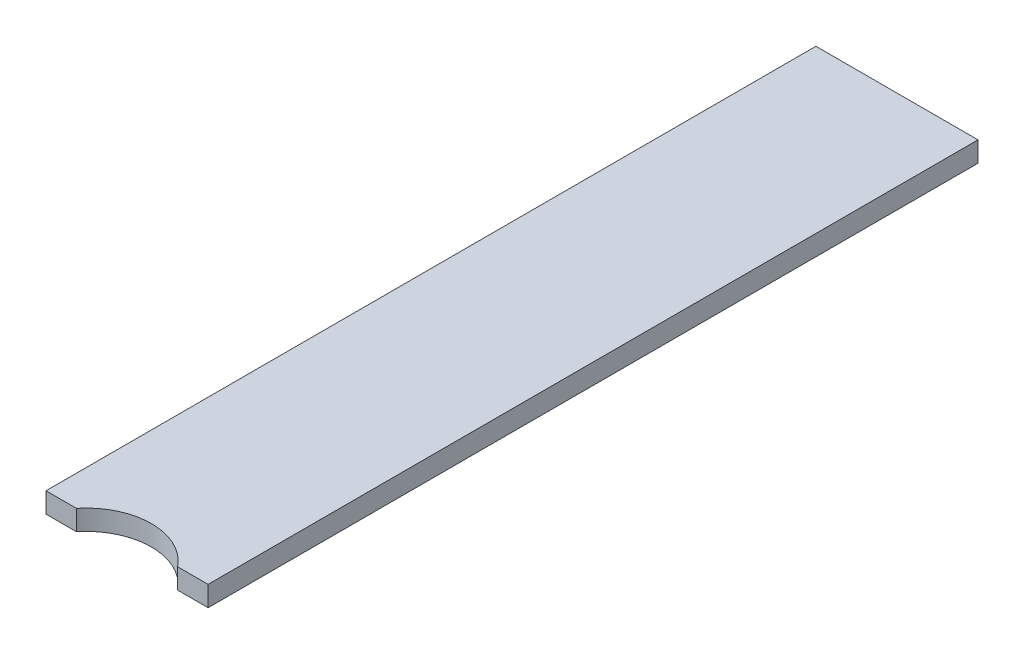
ISO-10303-21;
HEADER;
FILE_DESCRIPTION(('STEP AP214'),'2;1');
FILE_NAME('part.step','',(''),(''),'','','');
FILE_SCHEMA(('AUTOMOTIVE_DESIGN { 1 0 10303 214 1 1 1 1 }'));
ENDSEC;
DATA;
#1=APPLICATION_CONTEXT('core data for automotive mechanical design processes');
#2=APPLICATION_PROTOCOL_DEFINITION('international standard','automotive_design',2000,#1);
#3=PRODUCT_CONTEXT('',#1,'mechanical');
#4=PRODUCT('Part','Part','',(#3));
#5=PRODUCT_RELATED_PRODUCT_CATEGORY('part','',(#4));
#6=PRODUCT_DEFINITION_FORMATION('','',#4);
#7=PRODUCT_DEFINITION_CONTEXT('part definition',#1,'design');
#8=PRODUCT_DEFINITION('design','',#6,#7);
#9=PRODUCT_DEFINITION_SHAPE('','',#8);
#10=(LENGTH_UNIT() NAMED_UNIT(*) SI_UNIT(.MILLI.,.METRE.));
#11=(NAMED_UNIT(*) PLANE_ANGLE_UNIT() SI_UNIT($,.RADIAN.));
#12=(NAMED_UNIT(*) SI_UNIT($,.STERADIAN.) SOLID_ANGLE_UNIT());
#13=UNCERTAINTY_MEASURE_WITH_UNIT(LENGTH_MEASURE(1.E-05),#10,'distance_accuracy_value','');
#14=(GEOMETRIC_REPRESENTATION_CONTEXT(3) GLOBAL_UNCERTAINTY_ASSIGNED_CONTEXT((#13)) GLOBAL_UNIT_ASSIGNED_CONTEXT((#10,
#11,#12)) REPRESENTATION_CONTEXT('',''));
#15=CARTESIAN_POINT('',(0.,0.,0.));
#16=DIRECTION('',(0.,0.,1.));
#17=DIRECTION('',(1.,0.,0.));
#18=AXIS2_PLACEMENT_3D('',#15,#16,#17);
#19=CARTESIAN_POINT('',(0.,0.,200.));
#20=DIRECTION('',(1.,0.,0.));
#21=DIRECTION('',(0.,1.,0.));
#22=AXIS2_PLACEMENT_3D('',#19,#20,#21);
#23=PLANE('',#22);
#24=DIRECTION('',(0.,0.,-1.));
#25=VECTOR('',#24,1.);
#26=CARTESIAN_POINT('',(0.,-5.,200.));
#27=LINE('',#26,#25);
#28=CARTESIAN_POINT('',(0.,-5.,190.));
#29=VERTEX_POINT('',#28);
#30=CARTESIAN_POINT('',(0.,-5.,0.));
#31=VERTEX_POINT('',#30);
#32=EDGE_CURVE('E98',#29,#31,#27,.T.);
#33=ORIENTED_EDGE('',*,*,#32,.F.);
#34=DIRECTION('',(0.,-1.,0.));
#35=VECTOR('',#34,1.);
#36=CARTESIAN_POINT('',(0.,0.,190.));
#37=LINE('',#36,#35);
#38=CARTESIAN_POINT('',(0.,0.,190.));
#39=VERTEX_POINT('',#38);
#40=EDGE_CURVE('E87',#39,#29,#37,.T.);
#41=ORIENTED_EDGE('',*,*,#40,.F.);
#42=DIRECTION('',(0.,0.,-1.));
#43=VECTOR('',#42,1.);
#44=CARTESIAN_POINT('',(0.,0.,200.));
#45=LINE('',#44,#43);
#46=CARTESIAN_POINT('',(0.,0.,0.));
#47=VERTEX_POINT('',#46);
#48=EDGE_CURVE('E96',#39,#47,#45,.T.);
#49=ORIENTED_EDGE('',*,*,#48,.T.);
#50=DIRECTION('',(0.,-1.,0.));
#51=VECTOR('',#50,1.);
#52=CARTESIAN_POINT('',(0.,0.,0.));
#53=LINE('',#52,#51);
#54=EDGE_CURVE('E123',#47,#31,#53,.T.);
#55=ORIENTED_EDGE('',*,*,#54,.T.);
#56=EDGE_LOOP('',(#33,#41,#49,#55));
#57=FACE_BOUND('',#56,.T.);
#58=ADVANCED_FACE('F35',(#57),#23,.F.);
#59=CARTESIAN_POINT('',(0.,-5.,200.));
#60=DIRECTION('',(0.,1.,0.));
#61=DIRECTION('',(0.,0.,1.));
#62=AXIS2_PLACEMENT_3D('',#59,#60,#61);
#63=PLANE('',#62);
#64=DIRECTION('',(0.,0.,-1.));
#65=VECTOR('',#64,1.);
#66=CARTESIAN_POINT('',(40.,-5.,200.));
#67=LINE('',#66,#65);
#68=CARTESIAN_POINT('',(40.,-5.,190.));
#69=VERTEX_POINT('',#68);
#70=CARTESIAN_POINT('',(40.,-5.,0.));
#71=VERTEX_POINT('',#70);
#72=EDGE_CURVE('E107',#69,#71,#67,.T.);
#73=ORIENTED_EDGE('',*,*,#72,.F.);
#74=DIRECTION('',(1.,0.,0.));
#75=VECTOR('',#74,1.);
#76=CARTESIAN_POINT('',(0.,-5.,190.));
#77=LINE('',#76,#75);
#78=CARTESIAN_POINT('',(32.4899959967968,-5.,190.));
#79=VERTEX_POINT('',#78);
#80=EDGE_CURVE('E141',#79,#69,#77,.T.);
#81=ORIENTED_EDGE('',*,*,#80,.F.);
#82=CARTESIAN_POINT('',(20.,-5.00000000000001,200.));
#83=DIRECTION('',(0.,1.,0.));
#84=DIRECTION('',(-1.,0.,0.));
#85=AXIS2_PLACEMENT_3D('',#82,#83,#84);
#86=CIRCLE('',#85,16.);
#87=CARTESIAN_POINT('',(7.51000400320319,-5.00000000000001,190.));
#88=VERTEX_POINT('',#87);
#89=EDGE_CURVE('E119',#79,#88,#86,.T.);
#90=ORIENTED_EDGE('',*,*,#89,.T.);
#91=EDGE_CURVE('E49',#29,#88,#77,.T.);
#92=ORIENTED_EDGE('',*,*,#91,.F.);
#93=ORIENTED_EDGE('',*,*,#32,.T.);
#94=DIRECTION('',(1.,0.,0.));
#95=VECTOR('',#94,1.);
#96=CARTESIAN_POINT('',(0.,-5.,0.));
#97=LINE('',#96,#95);
#98=EDGE_CURVE('E129',#31,#71,#97,.T.);
#99=ORIENTED_EDGE('',*,*,#98,.T.);
#100=EDGE_LOOP('',(#73,#81,#90,#92,#93,#99));
#101=FACE_BOUND('',#100,.T.);
#102=ADVANCED_FACE('F140',(#101),#63,.F.);
#103=CARTESIAN_POINT('',(40.,0.,200.));
#104=DIRECTION('',(-1.,0.,0.));
#105=DIRECTION('',(0.,0.,1.));
#106=AXIS2_PLACEMENT_3D('',#103,#104,#105);
#107=PLANE('',#106);
#108=DIRECTION('',(0.,0.,-1.));
#109=VECTOR('',#108,1.);
#110=CARTESIAN_POINT('',(40.,0.,200.));
#111=LINE('',#110,#109);
#112=CARTESIAN_POINT('',(40.,0.,190.));
#113=VERTEX_POINT('',#112);
#114=CARTESIAN_POINT('',(40.,0.,0.));
#115=VERTEX_POINT('',#114);
#116=EDGE_CURVE('E105',#113,#115,#111,.T.);
#117=ORIENTED_EDGE('',*,*,#116,.F.);
#118=DIRECTION('',(0.,-1.,0.));
#119=VECTOR('',#118,1.);
#120=CARTESIAN_POINT('',(40.,0.,190.));
#121=LINE('',#120,#119);
#122=EDGE_CURVE('E99',#113,#69,#121,.T.);
#123=ORIENTED_EDGE('',*,*,#122,.T.);
#124=ORIENTED_EDGE('',*,*,#72,.T.);
#125=DIRECTION('',(0.,1.,0.));
#126=VECTOR('',#125,1.);
#127=CARTESIAN_POINT('',(40.,0.,0.));
#128=LINE('',#127,#126);
#129=EDGE_CURVE('E109',#71,#115,#128,.T.);
#130=ORIENTED_EDGE('',*,*,#129,.T.);
#131=EDGE_LOOP('',(#117,#123,#124,#130));
#132=FACE_BOUND('',#131,.T.);
#133=ADVANCED_FACE('F134',(#132),#107,.F.);
#134=CARTESIAN_POINT('',(0.,0.,200.));
#135=DIRECTION('',(0.,-1.,0.));
#136=DIRECTION('',(1.,0.,0.));
#137=AXIS2_PLACEMENT_3D('',#134,#135,#136);
#138=PLANE('',#137);
#139=ORIENTED_EDGE('',*,*,#48,.F.);
#140=DIRECTION('',(1.,0.,0.));
#141=VECTOR('',#140,1.);
#142=CARTESIAN_POINT('',(0.,0.,190.));
#143=LINE('',#142,#141);
#144=CARTESIAN_POINT('',(7.51000400320319,0.,190.));
#145=VERTEX_POINT('',#144);
#146=EDGE_CURVE('E84',#39,#145,#143,.T.);
#147=ORIENTED_EDGE('',*,*,#146,.T.);
#148=CARTESIAN_POINT('',(20.,0.,200.));
#149=DIRECTION('',(0.,1.,0.));
#150=DIRECTION('',(-1.,0.,0.));
#151=AXIS2_PLACEMENT_3D('',#148,#149,#150);
#152=CIRCLE('',#151,16.);
#153=CARTESIAN_POINT('',(32.4899959967968,0.,190.));
#154=VERTEX_POINT('',#153);
#155=EDGE_CURVE('E117',#154,#145,#152,.T.);
#156=ORIENTED_EDGE('',*,*,#155,.F.);
#157=EDGE_CURVE('E56',#154,#113,#143,.T.);
#158=ORIENTED_EDGE('',*,*,#157,.T.);
#159=ORIENTED_EDGE('',*,*,#116,.T.);
#160=DIRECTION('',(-1.,0.,0.));
#161=VECTOR('',#160,1.);
#162=CARTESIAN_POINT('',(0.,0.,0.));
#163=LINE('',#162,#161);
#164=EDGE_CURVE('E103',#115,#47,#163,.T.);
#165=ORIENTED_EDGE('',*,*,#164,.T.);
#166=EDGE_LOOP('',(#139,#147,#156,#158,#159,#165));
#167=FACE_BOUND('',#166,.T.);
#168=ADVANCED_FACE('F101',(#167),#138,.F.);
#169=CARTESIAN_POINT('',(0.,0.,0.));
#170=DIRECTION('',(0.,0.,1.));
#171=DIRECTION('',(1.,0.,0.));
#172=AXIS2_PLACEMENT_3D('',#169,#170,#171);
#173=PLANE('',#172);
#174=ORIENTED_EDGE('',*,*,#54,.F.);
#175=ORIENTED_EDGE('',*,*,#164,.F.);
#176=ORIENTED_EDGE('',*,*,#129,.F.);
#177=ORIENTED_EDGE('',*,*,#98,.F.);
#178=EDGE_LOOP('',(#174,#175,#176,#177));
#179=FACE_BOUND('',#178,.T.);
#180=ADVANCED_FACE('F138',(#179),#173,.F.);
#181=CARTESIAN_POINT('',(20.,-5.00000000000001,200.));
#182=DIRECTION('',(0.,1.,0.));
#183=DIRECTION('',(-1.,0.,0.));
#184=AXIS2_PLACEMENT_3D('',#181,#182,#183);
#185=CYLINDRICAL_SURFACE('',#184,16.);
#186=ORIENTED_EDGE('',*,*,#155,.T.);
#187=DIRECTION('',(0.,1.,0.));
#188=VECTOR('',#187,1.);
#189=CARTESIAN_POINT('',(7.51000400320319,-5.00000000000001,190.));
#190=LINE('',#189,#188);
#191=EDGE_CURVE('E11',#145,#88,#190,.F.);
#192=ORIENTED_EDGE('',*,*,#191,.T.);
#193=ORIENTED_EDGE('',*,*,#89,.F.);
#194=DIRECTION('',(0.,1.,0.));
#195=VECTOR('',#194,1.);
#196=CARTESIAN_POINT('',(32.4899959967968,-5.,190.));
#197=LINE('',#196,#195);
#198=EDGE_CURVE('E42',#79,#154,#197,.T.);
#199=ORIENTED_EDGE('',*,*,#198,.T.);
#200=EDGE_LOOP('',(#186,#192,#193,#199));
#201=FACE_BOUND('',#200,.T.);
#202=ADVANCED_FACE('F116',(#201),#185,.F.);
#203=CARTESIAN_POINT('',(0.,0.,190.));
#204=DIRECTION('',(0.,0.,-1.));
#205=DIRECTION('',(-1.,0.,0.));
#206=AXIS2_PLACEMENT_3D('',#203,#204,#205);
#207=PLANE('',#206);
#208=ORIENTED_EDGE('',*,*,#80,.T.);
#209=ORIENTED_EDGE('',*,*,#122,.F.);
#210=ORIENTED_EDGE('',*,*,#157,.F.);
#211=ORIENTED_EDGE('',*,*,#198,.F.);
#212=EDGE_LOOP('',(#208,#209,#210,#211));
#213=FACE_BOUND('',#212,.T.);
#214=ADVANCED_FACE('F143',(#213),#207,.F.);
#215=ORIENTED_EDGE('',*,*,#146,.F.);
#216=ORIENTED_EDGE('',*,*,#40,.T.);
#217=ORIENTED_EDGE('',*,*,#91,.T.);
#218=ORIENTED_EDGE('',*,*,#191,.F.);
#219=EDGE_LOOP('',(#215,#216,#217,#218));
#220=FACE_BOUND('',#219,.T.);
#221=ADVANCED_FACE('F86',(#220),#207,.F.);
#222=CLOSED_SHELL('',(#58,#102,#133,#168,#180,#202,#214,#221));
#223=MANIFOLD_SOLID_BREP('B2',#222);
#224=ADVANCED_BREP_SHAPE_REPRESENTATION('',(#18,#223),#14);
#225=SHAPE_DEFINITION_REPRESENTATION(#9,#224);
ENDSEC;
END-ISO-10303-21;
